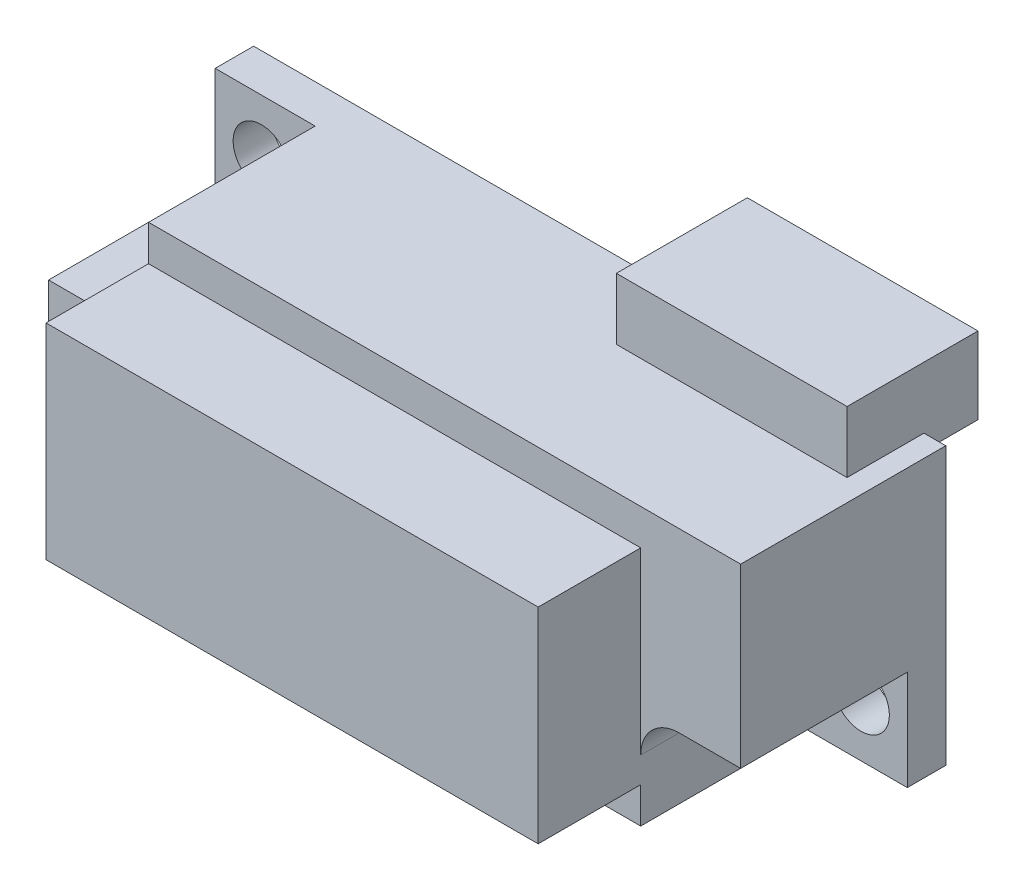
ISO-10303-21;
HEADER;
FILE_DESCRIPTION(('STEP AP214'),'2;1');
FILE_NAME('part.step','',(''),(''),'','','');
FILE_SCHEMA(('AUTOMOTIVE_DESIGN { 1 0 10303 214 1 1 1 1 }'));
ENDSEC;
DATA;
#1=APPLICATION_CONTEXT('core data for automotive mechanical design processes');
#2=APPLICATION_PROTOCOL_DEFINITION('international standard','automotive_design',2000,#1);
#3=PRODUCT_CONTEXT('',#1,'mechanical');
#4=PRODUCT('Part','Part','',(#3));
#5=PRODUCT_RELATED_PRODUCT_CATEGORY('part','',(#4));
#6=PRODUCT_DEFINITION_FORMATION('','',#4);
#7=PRODUCT_DEFINITION_CONTEXT('part definition',#1,'design');
#8=PRODUCT_DEFINITION('design','',#6,#7);
#9=PRODUCT_DEFINITION_SHAPE('','',#8);
#10=(LENGTH_UNIT() NAMED_UNIT(*) SI_UNIT(.MILLI.,.METRE.));
#11=(NAMED_UNIT(*) PLANE_ANGLE_UNIT() SI_UNIT($,.RADIAN.));
#12=(NAMED_UNIT(*) SI_UNIT($,.STERADIAN.) SOLID_ANGLE_UNIT());
#13=UNCERTAINTY_MEASURE_WITH_UNIT(LENGTH_MEASURE(1.E-05),#10,'distance_accuracy_value','');
#14=(GEOMETRIC_REPRESENTATION_CONTEXT(3) GLOBAL_UNCERTAINTY_ASSIGNED_CONTEXT((#13)) GLOBAL_UNIT_ASSIGNED_CONTEXT((#10,
#11,#12)) REPRESENTATION_CONTEXT('',''));
#15=CARTESIAN_POINT('',(0.,0.,0.));
#16=DIRECTION('',(0.,0.,1.));
#17=DIRECTION('',(1.,0.,0.));
#18=AXIS2_PLACEMENT_3D('',#15,#16,#17);
#19=CARTESIAN_POINT('',(-26.1452834227024,14.8512324203786,12.));
#20=DIRECTION('',(1.,0.,0.));
#21=DIRECTION('',(0.,1.,0.));
#22=AXIS2_PLACEMENT_3D('',#19,#20,#21);
#23=PLANE('',#22);
#24=DIRECTION('',(0.,-1.,0.));
#25=VECTOR('',#24,1.);
#26=CARTESIAN_POINT('',(-26.1452834227024,14.8512324203786,8.));
#27=LINE('',#26,#25);
#28=CARTESIAN_POINT('',(-26.1452834227024,10.9512324203803,8.));
#29=VERTEX_POINT('',#28);
#30=CARTESIAN_POINT('',(-26.1452834227024,4.05123242037859,8.));
#31=VERTEX_POINT('',#30);
#32=EDGE_CURVE('E245',#29,#31,#27,.T.);
#33=ORIENTED_EDGE('',*,*,#32,.F.);
#34=DIRECTION('',(0.,0.,1.));
#35=VECTOR('',#34,1.);
#36=CARTESIAN_POINT('',(-26.1452834227024,10.9512324203803,1.5));
#37=LINE('',#36,#35);
#38=CARTESIAN_POINT('',(-26.1452834227024,10.9512324203803,1.5));
#39=VERTEX_POINT('',#38);
#40=EDGE_CURVE('E310',#39,#29,#37,.T.);
#41=ORIENTED_EDGE('',*,*,#40,.F.);
#42=DIRECTION('',(0.,-1.,0.));
#43=VECTOR('',#42,1.);
#44=CARTESIAN_POINT('',(-26.1452834227024,14.8512324203786,1.5));
#45=LINE('',#44,#43);
#46=CARTESIAN_POINT('',(-26.1452834227024,14.8512324203786,1.5));
#47=VERTEX_POINT('',#46);
#48=EDGE_CURVE('E300',#47,#39,#45,.T.);
#49=ORIENTED_EDGE('',*,*,#48,.F.);
#50=DIRECTION('',(0.,0.,-1.));
#51=VECTOR('',#50,1.);
#52=CARTESIAN_POINT('',(-26.1452834227024,14.8512324203786,12.));
#53=LINE('',#52,#51);
#54=CARTESIAN_POINT('',(-26.1452834227024,14.8512324203786,0.));
#55=VERTEX_POINT('',#54);
#56=EDGE_CURVE('E331',#47,#55,#53,.T.);
#57=ORIENTED_EDGE('',*,*,#56,.T.);
#58=DIRECTION('',(0.,-1.,0.));
#59=VECTOR('',#58,1.);
#60=CARTESIAN_POINT('',(-26.1452834227024,14.8512324203786,0.));
#61=LINE('',#60,#59);
#62=CARTESIAN_POINT('',(-26.1452834227025,4.05123242037859,0.));
#63=VERTEX_POINT('',#62);
#64=EDGE_CURVE('E316',#55,#63,#61,.T.);
#65=ORIENTED_EDGE('',*,*,#64,.T.);
#66=DIRECTION('',(0.,0.,-1.));
#67=VECTOR('',#66,1.);
#68=CARTESIAN_POINT('',(-26.1452834227025,4.05123242037859,12.));
#69=LINE('',#68,#67);
#70=EDGE_CURVE('E338',#31,#63,#69,.T.);
#71=ORIENTED_EDGE('',*,*,#70,.F.);
#72=EDGE_LOOP('',(#33,#41,#49,#57,#65,#71));
#73=FACE_BOUND('',#72,.T.);
#74=ADVANCED_FACE('F34',(#73),#23,.F.);
#75=CARTESIAN_POINT('',(-26.1452834227025,4.05123242037859,12.));
#76=DIRECTION('',(0.,1.,0.));
#77=DIRECTION('',(0.,0.,1.));
#78=AXIS2_PLACEMENT_3D('',#75,#76,#77);
#79=PLANE('',#78);
#80=DIRECTION('',(1.,0.,0.));
#81=VECTOR('',#80,1.);
#82=CARTESIAN_POINT('',(-26.1452834227024,4.05123242037859,8.));
#83=LINE('',#82,#81);
#84=CARTESIAN_POINT('',(-3.04528342269798,4.05123242037859,8.));
#85=VERTEX_POINT('',#84);
#86=EDGE_CURVE('E254',#31,#85,#83,.T.);
#87=ORIENTED_EDGE('',*,*,#86,.F.);
#88=ORIENTED_EDGE('',*,*,#70,.T.);
#89=DIRECTION('',(1.,0.,0.));
#90=VECTOR('',#89,1.);
#91=CARTESIAN_POINT('',(-26.1452834227025,4.05123242037859,0.));
#92=LINE('',#91,#90);
#93=CARTESIAN_POINT('',(0.85471657729755,4.05123242037859,0.));
#94=VERTEX_POINT('',#93);
#95=EDGE_CURVE('E321',#63,#94,#92,.T.);
#96=ORIENTED_EDGE('',*,*,#95,.T.);
#97=DIRECTION('',(0.,0.,-1.));
#98=VECTOR('',#97,1.);
#99=CARTESIAN_POINT('',(0.85471657729755,4.05123242037859,12.));
#100=LINE('',#99,#98);
#101=CARTESIAN_POINT('',(0.85471657729755,4.05123242037859,1.5));
#102=VERTEX_POINT('',#101);
#103=EDGE_CURVE('E336',#102,#94,#100,.T.);
#104=ORIENTED_EDGE('',*,*,#103,.F.);
#105=DIRECTION('',(1.,0.,0.));
#106=VECTOR('',#105,1.);
#107=CARTESIAN_POINT('',(-3.04528342269798,4.05123242037859,1.5));
#108=LINE('',#107,#106);
#109=CARTESIAN_POINT('',(-3.04528342269798,4.05123242037859,1.5));
#110=VERTEX_POINT('',#109);
#111=EDGE_CURVE('E285',#110,#102,#108,.T.);
#112=ORIENTED_EDGE('',*,*,#111,.F.);
#113=DIRECTION('',(0.,0.,1.));
#114=VECTOR('',#113,1.);
#115=CARTESIAN_POINT('',(-3.04528342269798,4.05123242037859,1.5));
#116=LINE('',#115,#114);
#117=EDGE_CURVE('E291',#110,#85,#116,.T.);
#118=ORIENTED_EDGE('',*,*,#117,.T.);
#119=EDGE_LOOP('',(#87,#88,#96,#104,#112,#118));
#120=FACE_BOUND('',#119,.T.);
#121=ADVANCED_FACE('F408',(#120),#79,.F.);
#122=CARTESIAN_POINT('',(0.854716577297548,14.8512324203786,12.));
#123=DIRECTION('',(-1.,0.,0.));
#124=DIRECTION('',(0.,-1.,0.));
#125=AXIS2_PLACEMENT_3D('',#122,#123,#124);
#126=PLANE('',#125);
#127=DIRECTION('',(0.,1.,0.));
#128=VECTOR('',#127,1.);
#129=CARTESIAN_POINT('',(0.85471657729755,14.8512324203786,8.));
#130=LINE('',#129,#128);
#131=CARTESIAN_POINT('',(0.85471657729755,7.95123242037313,8.));
#132=VERTEX_POINT('',#131);
#133=CARTESIAN_POINT('',(0.85471657729755,14.8512324203786,8.));
#134=VERTEX_POINT('',#133);
#135=EDGE_CURVE('E256',#132,#134,#130,.T.);
#136=ORIENTED_EDGE('',*,*,#135,.F.);
#137=DIRECTION('',(0.,0.,1.));
#138=VECTOR('',#137,1.);
#139=CARTESIAN_POINT('',(0.85471657729755,7.95123242037313,1.5));
#140=LINE('',#139,#138);
#141=CARTESIAN_POINT('',(0.85471657729755,7.95123242037313,1.5));
#142=VERTEX_POINT('',#141);
#143=EDGE_CURVE('E294',#142,#132,#140,.T.);
#144=ORIENTED_EDGE('',*,*,#143,.F.);
#145=DIRECTION('',(0.,1.,0.));
#146=VECTOR('',#145,1.);
#147=CARTESIAN_POINT('',(0.85471657729755,7.95123242037313,1.5));
#148=LINE('',#147,#146);
#149=EDGE_CURVE('E287',#102,#142,#148,.T.);
#150=ORIENTED_EDGE('',*,*,#149,.F.);
#151=ORIENTED_EDGE('',*,*,#103,.T.);
#152=DIRECTION('',(0.,1.,0.));
#153=VECTOR('',#152,1.);
#154=CARTESIAN_POINT('',(0.854716577297548,14.8512324203786,0.));
#155=LINE('',#154,#153);
#156=CARTESIAN_POINT('',(0.854716577297548,14.8512324203786,0.));
#157=VERTEX_POINT('',#156);
#158=EDGE_CURVE('E324',#94,#157,#155,.T.);
#159=ORIENTED_EDGE('',*,*,#158,.T.);
#160=DIRECTION('',(0.,0.,-1.));
#161=VECTOR('',#160,1.);
#162=CARTESIAN_POINT('',(0.854716577297548,14.8512324203786,12.));
#163=LINE('',#162,#161);
#164=EDGE_CURVE('E334',#134,#157,#163,.T.);
#165=ORIENTED_EDGE('',*,*,#164,.F.);
#166=EDGE_LOOP('',(#136,#144,#150,#151,#159,#165));
#167=FACE_BOUND('',#166,.T.);
#168=ADVANCED_FACE('F370',(#167),#126,.F.);
#169=CARTESIAN_POINT('',(-26.1452834227024,14.8512324203786,12.));
#170=DIRECTION('',(0.,-1.,0.));
#171=DIRECTION('',(0.,0.,-1.));
#172=AXIS2_PLACEMENT_3D('',#169,#170,#171);
#173=PLANE('',#172);
#174=DIRECTION('',(-1.,0.,0.));
#175=VECTOR('',#174,1.);
#176=CARTESIAN_POINT('',(-26.1452834227024,14.8512324203786,0.));
#177=LINE('',#176,#175);
#178=CARTESIAN_POINT('',(0.00471657729754944,14.8512324203786,0.));
#179=VERTEX_POINT('',#178);
#180=EDGE_CURVE('E328',#157,#179,#177,.T.);
#181=ORIENTED_EDGE('',*,*,#180,.T.);
#182=DIRECTION('',(0.,0.,1.));
#183=VECTOR('',#182,1.);
#184=CARTESIAN_POINT('',(0.00471657729755187,14.8512324203786,12.));
#185=LINE('',#184,#183);
#186=CARTESIAN_POINT('',(0.00471657729754944,14.8512324203786,3.));
#187=VERTEX_POINT('',#186);
#188=EDGE_CURVE('E223',#179,#187,#185,.T.);
#189=ORIENTED_EDGE('',*,*,#188,.T.);
#190=DIRECTION('',(1.,0.,0.));
#191=VECTOR('',#190,1.);
#192=CARTESIAN_POINT('',(-26.1452834227024,14.8512324203786,3.));
#193=LINE('',#192,#191);
#194=CARTESIAN_POINT('',(-8.99528342270245,14.8512324203786,3.));
#195=VERTEX_POINT('',#194);
#196=EDGE_CURVE('E11',#195,#187,#193,.T.);
#197=ORIENTED_EDGE('',*,*,#196,.F.);
#198=DIRECTION('',(0.,0.,-1.));
#199=VECTOR('',#198,1.);
#200=CARTESIAN_POINT('',(-8.99528342270245,14.8512324203786,12.));
#201=LINE('',#200,#199);
#202=CARTESIAN_POINT('',(-8.99528342270245,14.8512324203786,0.));
#203=VERTEX_POINT('',#202);
#204=EDGE_CURVE('E217',#195,#203,#201,.T.);
#205=ORIENTED_EDGE('',*,*,#204,.T.);
#206=EDGE_CURVE('E327',#203,#55,#177,.T.);
#207=ORIENTED_EDGE('',*,*,#206,.T.);
#208=ORIENTED_EDGE('',*,*,#56,.F.);
#209=DIRECTION('',(-1.,0.,0.));
#210=VECTOR('',#209,1.);
#211=CARTESIAN_POINT('',(-26.1452834227024,14.8512324203786,1.5));
#212=LINE('',#211,#210);
#213=CARTESIAN_POINT('',(-22.245283422704,14.8512324203786,1.5));
#214=VERTEX_POINT('',#213);
#215=EDGE_CURVE('E308',#214,#47,#212,.T.);
#216=ORIENTED_EDGE('',*,*,#215,.F.);
#217=DIRECTION('',(0.,0.,1.));
#218=VECTOR('',#217,1.);
#219=CARTESIAN_POINT('',(-22.245283422704,14.8512324203786,1.5));
#220=LINE('',#219,#218);
#221=CARTESIAN_POINT('',(-22.245283422704,14.8512324203786,8.));
#222=VERTEX_POINT('',#221);
#223=EDGE_CURVE('E313',#214,#222,#220,.T.);
#224=ORIENTED_EDGE('',*,*,#223,.T.);
#225=DIRECTION('',(-1.,0.,0.));
#226=VECTOR('',#225,1.);
#227=CARTESIAN_POINT('',(-26.1452834227024,14.8512324203786,8.));
#228=LINE('',#227,#226);
#229=EDGE_CURVE('E258',#134,#222,#228,.T.);
#230=ORIENTED_EDGE('',*,*,#229,.F.);
#231=ORIENTED_EDGE('',*,*,#164,.T.);
#232=EDGE_LOOP('',(#181,#189,#197,#205,#207,#208,#216,#224,#230,#231));
#233=FACE_BOUND('',#232,.T.);
#234=ADVANCED_FACE('F364',(#233),#173,.F.);
#235=CARTESIAN_POINT('',(0.,0.,12.));
#236=DIRECTION('',(0.,0.,1.));
#237=DIRECTION('',(1.,0.,0.));
#238=AXIS2_PLACEMENT_3D('',#235,#236,#237);
#239=PLANE('',#238);
#240=DIRECTION('',(0.,-1.,0.));
#241=VECTOR('',#240,1.);
#242=CARTESIAN_POINT('',(-3.04528342269798,7.95123242037313,12.));
#243=LINE('',#242,#241);
#244=CARTESIAN_POINT('',(-3.04528342270245,13.4512324203786,12.));
#245=VERTEX_POINT('',#244);
#246=CARTESIAN_POINT('',(-3.04528342270245,5.4512324203786,12.));
#247=VERTEX_POINT('',#246);
#248=EDGE_CURVE('E282',#245,#247,#243,.T.);
#249=ORIENTED_EDGE('',*,*,#248,.F.);
#250=DIRECTION('',(-1.,0.,0.));
#251=VECTOR('',#250,1.);
#252=CARTESIAN_POINT('',(-22.2452834227024,13.4512324203786,12.));
#253=LINE('',#252,#251);
#254=CARTESIAN_POINT('',(-22.2452834227024,13.4512324203786,12.));
#255=VERTEX_POINT('',#254);
#256=EDGE_CURVE('E230',#245,#255,#253,.T.);
#257=ORIENTED_EDGE('',*,*,#256,.T.);
#258=DIRECTION('',(0.,1.,0.));
#259=VECTOR('',#258,1.);
#260=CARTESIAN_POINT('',(-22.245283422704,14.8512324203786,12.));
#261=LINE('',#260,#259);
#262=CARTESIAN_POINT('',(-22.2452834227024,5.4512324203786,12.));
#263=VERTEX_POINT('',#262);
#264=EDGE_CURVE('E297',#263,#255,#261,.T.);
#265=ORIENTED_EDGE('',*,*,#264,.F.);
#266=DIRECTION('',(1.,0.,0.));
#267=VECTOR('',#266,1.);
#268=CARTESIAN_POINT('',(-22.2452834227024,5.4512324203786,12.));
#269=LINE('',#268,#267);
#270=EDGE_CURVE('E226',#263,#247,#269,.T.);
#271=ORIENTED_EDGE('',*,*,#270,.T.);
#272=EDGE_LOOP('',(#249,#257,#265,#271));
#273=FACE_BOUND('',#272,.T.);
#274=ADVANCED_FACE('F454',(#273),#239,.T.);
#275=CARTESIAN_POINT('',(-26.1452834227024,10.9512324203803,1.5));
#276=DIRECTION('',(0.,-1.,0.));
#277=DIRECTION('',(0.,0.,-1.));
#278=AXIS2_PLACEMENT_3D('',#275,#276,#277);
#279=PLANE('',#278);
#280=DIRECTION('',(-1.,0.,0.));
#281=VECTOR('',#280,1.);
#282=CARTESIAN_POINT('',(-26.1452834227024,10.9512324203803,8.));
#283=LINE('',#282,#281);
#284=CARTESIAN_POINT('',(-23.745283422704,10.9512324203803,8.));
#285=VERTEX_POINT('',#284);
#286=EDGE_CURVE('E264',#285,#29,#283,.T.);
#287=ORIENTED_EDGE('',*,*,#286,.F.);
#288=DIRECTION('',(0.,0.,1.));
#289=VECTOR('',#288,1.);
#290=CARTESIAN_POINT('',(-23.745283422704,10.9512324203803,1.5));
#291=LINE('',#290,#289);
#292=CARTESIAN_POINT('',(-23.745283422704,10.9512324203803,1.5));
#293=VERTEX_POINT('',#292);
#294=EDGE_CURVE('E343',#285,#293,#291,.F.);
#295=ORIENTED_EDGE('',*,*,#294,.T.);
#296=DIRECTION('',(1.,0.,0.));
#297=VECTOR('',#296,1.);
#298=CARTESIAN_POINT('',(-26.1452834227024,10.9512324203803,1.5));
#299=LINE('',#298,#297);
#300=EDGE_CURVE('E303',#39,#293,#299,.T.);
#301=ORIENTED_EDGE('',*,*,#300,.F.);
#302=ORIENTED_EDGE('',*,*,#40,.T.);
#303=EDGE_LOOP('',(#287,#295,#301,#302));
#304=FACE_BOUND('',#303,.T.);
#305=ADVANCED_FACE('F424',(#304),#279,.F.);
#306=CARTESIAN_POINT('',(-3.04528342269798,7.95123242037313,1.5));
#307=DIRECTION('',(0.,1.,0.));
#308=DIRECTION('',(0.,0.,1.));
#309=AXIS2_PLACEMENT_3D('',#306,#307,#308);
#310=PLANE('',#309);
#311=DIRECTION('',(1.,0.,0.));
#312=VECTOR('',#311,1.);
#313=CARTESIAN_POINT('',(-3.04528342269798,7.95123242037313,8.));
#314=LINE('',#313,#312);
#315=CARTESIAN_POINT('',(-1.54528342269798,7.95123242037313,8.));
#316=VERTEX_POINT('',#315);
#317=EDGE_CURVE('E260',#316,#132,#314,.T.);
#318=ORIENTED_EDGE('',*,*,#317,.F.);
#319=DIRECTION('',(0.,0.,1.));
#320=VECTOR('',#319,1.);
#321=CARTESIAN_POINT('',(-1.54528342269798,7.95123242037313,1.5));
#322=LINE('',#321,#320);
#323=CARTESIAN_POINT('',(-1.54528342269798,7.95123242037313,1.5));
#324=VERTEX_POINT('',#323);
#325=EDGE_CURVE('E57',#316,#324,#322,.F.);
#326=ORIENTED_EDGE('',*,*,#325,.T.);
#327=DIRECTION('',(-1.,0.,0.));
#328=VECTOR('',#327,1.);
#329=CARTESIAN_POINT('',(-3.04528342269798,7.95123242037313,1.5));
#330=LINE('',#329,#328);
#331=EDGE_CURVE('E289',#142,#324,#330,.T.);
#332=ORIENTED_EDGE('',*,*,#331,.F.);
#333=ORIENTED_EDGE('',*,*,#143,.T.);
#334=EDGE_LOOP('',(#318,#326,#332,#333));
#335=FACE_BOUND('',#334,.T.);
#336=ADVANCED_FACE('F417',(#335),#310,.F.);
#337=CARTESIAN_POINT('',(-23.745283422704,12.4512324203803,1.5));
#338=DIRECTION('',(0.,0.,-1.));
#339=DIRECTION('',(-1.,0.,0.));
#340=AXIS2_PLACEMENT_3D('',#337,#338,#339);
#341=CYLINDRICAL_SURFACE('',#340,1.5);
#342=CARTESIAN_POINT('',(-23.745283422704,12.4512324203803,8.));
#343=DIRECTION('',(0.,0.,1.));
#344=DIRECTION('',(1.,0.,0.));
#345=AXIS2_PLACEMENT_3D('',#342,#343,#344);
#346=CIRCLE('',#345,1.5);
#347=CARTESIAN_POINT('',(-22.2452834227024,12.4512324203803,8.));
#348=VERTEX_POINT('',#347);
#349=EDGE_CURVE('E262',#348,#285,#346,.F.);
#350=ORIENTED_EDGE('',*,*,#349,.F.);
#351=DIRECTION('',(0.,0.,1.));
#352=VECTOR('',#351,1.);
#353=CARTESIAN_POINT('',(-22.245283422704,12.4512324203803,12.));
#354=LINE('',#353,#352);
#355=CARTESIAN_POINT('',(-22.245283422704,12.4512324203803,1.5));
#356=VERTEX_POINT('',#355);
#357=EDGE_CURVE('E340',#356,#348,#354,.T.);
#358=ORIENTED_EDGE('',*,*,#357,.F.);
#359=CARTESIAN_POINT('',(-23.745283422704,12.4512324203803,1.5));
#360=DIRECTION('',(0.,0.,1.));
#361=DIRECTION('',(1.,0.,0.));
#362=AXIS2_PLACEMENT_3D('',#359,#360,#361);
#363=CIRCLE('',#362,1.5);
#364=EDGE_CURVE('E345',#293,#356,#363,.T.);
#365=ORIENTED_EDGE('',*,*,#364,.F.);
#366=ORIENTED_EDGE('',*,*,#294,.F.);
#367=EDGE_LOOP('',(#350,#358,#365,#366));
#368=FACE_BOUND('',#367,.T.);
#369=ADVANCED_FACE('F415',(#368),#341,.F.);
#370=CARTESIAN_POINT('',(-1.54528342269798,6.45123242037313,1.5));
#371=DIRECTION('',(0.,0.,-1.));
#372=DIRECTION('',(-1.,0.,0.));
#373=AXIS2_PLACEMENT_3D('',#370,#371,#372);
#374=CYLINDRICAL_SURFACE('',#373,1.5);
#375=CARTESIAN_POINT('',(-1.54528342269798,6.45123242037313,8.));
#376=DIRECTION('',(0.,0.,1.));
#377=DIRECTION('',(1.,0.,0.));
#378=AXIS2_PLACEMENT_3D('',#375,#376,#377);
#379=CIRCLE('',#378,1.5);
#380=CARTESIAN_POINT('',(-3.04528342270245,6.45123242037313,8.));
#381=VERTEX_POINT('',#380);
#382=EDGE_CURVE('E353',#381,#316,#379,.F.);
#383=ORIENTED_EDGE('',*,*,#382,.F.);
#384=DIRECTION('',(0.,0.,1.));
#385=VECTOR('',#384,1.);
#386=CARTESIAN_POINT('',(-3.04528342269798,6.45123242037313,12.));
#387=LINE('',#386,#385);
#388=CARTESIAN_POINT('',(-3.04528342269798,6.45123242037313,1.5));
#389=VERTEX_POINT('',#388);
#390=EDGE_CURVE('E347',#389,#381,#387,.T.);
#391=ORIENTED_EDGE('',*,*,#390,.F.);
#392=CARTESIAN_POINT('',(-1.54528342269798,6.45123242037313,1.5));
#393=DIRECTION('',(0.,0.,1.));
#394=DIRECTION('',(1.,0.,0.));
#395=AXIS2_PLACEMENT_3D('',#392,#393,#394);
#396=CIRCLE('',#395,1.5);
#397=EDGE_CURVE('E351',#324,#389,#396,.T.);
#398=ORIENTED_EDGE('',*,*,#397,.F.);
#399=ORIENTED_EDGE('',*,*,#325,.F.);
#400=EDGE_LOOP('',(#383,#391,#398,#399));
#401=FACE_BOUND('',#400,.T.);
#402=ADVANCED_FACE('F36',(#401),#374,.F.);
#403=CARTESIAN_POINT('',(0.,0.,0.));
#404=DIRECTION('',(0.,0.,1.));
#405=DIRECTION('',(1.,0.,0.));
#406=AXIS2_PLACEMENT_3D('',#403,#404,#405);
#407=PLANE('',#406);
#408=CARTESIAN_POINT('',(-0.94528342270245,6.1512324203786,0.));
#409=DIRECTION('',(0.,0.,1.));
#410=DIRECTION('',(1.,0.,0.));
#411=AXIS2_PLACEMENT_3D('',#408,#409,#410);
#412=CIRCLE('',#411,1.1);
#413=CARTESIAN_POINT('',(0.15471657729755,6.1512324203786,0.));
#414=VERTEX_POINT('',#413);
#415=EDGE_CURVE('E273',#414,#414,#412,.T.);
#416=ORIENTED_EDGE('',*,*,#415,.T.);
#417=EDGE_LOOP('',(#416));
#418=FACE_BOUND('',#417,.T.);
#419=CARTESIAN_POINT('',(-24.3452834227024,12.7512324203786,0.));
#420=DIRECTION('',(0.,0.,1.));
#421=DIRECTION('',(1.,0.,0.));
#422=AXIS2_PLACEMENT_3D('',#419,#420,#421);
#423=CIRCLE('',#422,1.1);
#424=CARTESIAN_POINT('',(-23.2452834227024,12.7512324203786,0.));
#425=VERTEX_POINT('',#424);
#426=EDGE_CURVE('E279',#425,#425,#423,.T.);
#427=ORIENTED_EDGE('',*,*,#426,.T.);
#428=EDGE_LOOP('',(#427));
#429=FACE_BOUND('',#428,.T.);
#430=DIRECTION('',(1.,0.,0.));
#431=VECTOR('',#430,1.);
#432=CARTESIAN_POINT('',(0.,14.2512324203786,0.));
#433=LINE('',#432,#431);
#434=CARTESIAN_POINT('',(-8.99528342270245,14.2512324203786,0.));
#435=VERTEX_POINT('',#434);
#436=CARTESIAN_POINT('',(0.00471657729754927,14.2512324203786,0.));
#437=VERTEX_POINT('',#436);
#438=EDGE_CURVE('E355',#435,#437,#433,.T.);
#439=ORIENTED_EDGE('',*,*,#438,.T.);
#440=DIRECTION('',(0.,1.,0.));
#441=VECTOR('',#440,1.);
#442=CARTESIAN_POINT('',(0.00471657729754515,0.,0.));
#443=LINE('',#442,#441);
#444=EDGE_CURVE('E42',#437,#179,#443,.T.);
#445=ORIENTED_EDGE('',*,*,#444,.T.);
#446=ORIENTED_EDGE('',*,*,#180,.F.);
#447=ORIENTED_EDGE('',*,*,#158,.F.);
#448=ORIENTED_EDGE('',*,*,#95,.F.);
#449=ORIENTED_EDGE('',*,*,#64,.F.);
#450=ORIENTED_EDGE('',*,*,#206,.F.);
#451=DIRECTION('',(0.,-1.,0.));
#452=VECTOR('',#451,1.);
#453=CARTESIAN_POINT('',(-8.99528342270244,0.,0.));
#454=LINE('',#453,#452);
#455=EDGE_CURVE('E357',#203,#435,#454,.T.);
#456=ORIENTED_EDGE('',*,*,#455,.T.);
#457=EDGE_LOOP('',(#439,#445,#446,#447,#448,#449,#450,#456));
#458=FACE_BOUND('',#457,.T.);
#459=ADVANCED_FACE('F361',(#418,#429,#458),#407,.F.);
#460=CARTESIAN_POINT('',(-22.245283422704,14.8512324203786,1.5));
#461=DIRECTION('',(1.,0.,0.));
#462=DIRECTION('',(0.,0.,-1.));
#463=AXIS2_PLACEMENT_3D('',#460,#461,#462);
#464=PLANE('',#463);
#465=DIRECTION('',(0.,0.,1.));
#466=VECTOR('',#465,1.);
#467=CARTESIAN_POINT('',(-22.2452834227024,13.4512324203786,8.));
#468=LINE('',#467,#466);
#469=CARTESIAN_POINT('',(-22.2452834227024,13.4512324203786,8.));
#470=VERTEX_POINT('',#469);
#471=EDGE_CURVE('E243',#470,#255,#468,.T.);
#472=ORIENTED_EDGE('',*,*,#471,.F.);
#473=DIRECTION('',(0.,-1.,0.));
#474=VECTOR('',#473,1.);
#475=CARTESIAN_POINT('',(-22.245283422704,14.8512324203786,8.));
#476=LINE('',#475,#474);
#477=EDGE_CURVE('E268',#222,#470,#476,.T.);
#478=ORIENTED_EDGE('',*,*,#477,.F.);
#479=ORIENTED_EDGE('',*,*,#223,.F.);
#480=DIRECTION('',(0.,1.,0.));
#481=VECTOR('',#480,1.);
#482=CARTESIAN_POINT('',(-22.245283422704,14.8512324203786,1.5));
#483=LINE('',#482,#481);
#484=EDGE_CURVE('E306',#356,#214,#483,.T.);
#485=ORIENTED_EDGE('',*,*,#484,.F.);
#486=ORIENTED_EDGE('',*,*,#357,.T.);
#487=DIRECTION('',(0.,-1.,0.));
#488=VECTOR('',#487,1.);
#489=CARTESIAN_POINT('',(-22.2452834227024,13.4512324203786,8.));
#490=LINE('',#489,#488);
#491=CARTESIAN_POINT('',(-22.2452834227024,5.4512324203786,8.));
#492=VERTEX_POINT('',#491);
#493=EDGE_CURVE('E227',#348,#492,#490,.T.);
#494=ORIENTED_EDGE('',*,*,#493,.T.);
#495=DIRECTION('',(0.,0.,1.));
#496=VECTOR('',#495,1.);
#497=CARTESIAN_POINT('',(-22.2452834227024,5.4512324203786,8.));
#498=LINE('',#497,#496);
#499=EDGE_CURVE('E238',#492,#263,#498,.T.);
#500=ORIENTED_EDGE('',*,*,#499,.T.);
#501=ORIENTED_EDGE('',*,*,#264,.T.);
#502=EDGE_LOOP('',(#472,#478,#479,#485,#486,#494,#500,#501));
#503=FACE_BOUND('',#502,.T.);
#504=ADVANCED_FACE('F435',(#503),#464,.F.);
#505=CARTESIAN_POINT('',(0.,0.,1.5));
#506=DIRECTION('',(0.,0.,1.));
#507=DIRECTION('',(1.,0.,0.));
#508=AXIS2_PLACEMENT_3D('',#505,#506,#507);
#509=PLANE('',#508);
#510=CARTESIAN_POINT('',(-24.3452834227024,12.7512324203786,1.5));
#511=DIRECTION('',(0.,0.,1.));
#512=DIRECTION('',(1.,0.,0.));
#513=AXIS2_PLACEMENT_3D('',#510,#511,#512);
#514=CIRCLE('',#513,1.1);
#515=CARTESIAN_POINT('',(-23.2452834227024,12.7512324203786,1.5));
#516=VERTEX_POINT('',#515);
#517=EDGE_CURVE('E276',#516,#516,#514,.T.);
#518=ORIENTED_EDGE('',*,*,#517,.F.);
#519=EDGE_LOOP('',(#518));
#520=FACE_BOUND('',#519,.T.);
#521=ORIENTED_EDGE('',*,*,#300,.T.);
#522=ORIENTED_EDGE('',*,*,#364,.T.);
#523=ORIENTED_EDGE('',*,*,#484,.T.);
#524=ORIENTED_EDGE('',*,*,#215,.T.);
#525=ORIENTED_EDGE('',*,*,#48,.T.);
#526=EDGE_LOOP('',(#521,#522,#523,#524,#525));
#527=FACE_BOUND('',#526,.T.);
#528=ADVANCED_FACE('F440',(#520,#527),#509,.T.);
#529=CARTESIAN_POINT('',(-3.04528342269798,7.95123242037313,1.5));
#530=DIRECTION('',(-1.,0.,0.));
#531=DIRECTION('',(0.,0.,1.));
#532=AXIS2_PLACEMENT_3D('',#529,#530,#531);
#533=PLANE('',#532);
#534=DIRECTION('',(0.,0.,1.));
#535=VECTOR('',#534,1.);
#536=CARTESIAN_POINT('',(-3.04528342270245,5.4512324203786,8.));
#537=LINE('',#536,#535);
#538=CARTESIAN_POINT('',(-3.04528342270245,5.4512324203786,8.));
#539=VERTEX_POINT('',#538);
#540=EDGE_CURVE('E249',#539,#247,#537,.T.);
#541=ORIENTED_EDGE('',*,*,#540,.F.);
#542=DIRECTION('',(0.,1.,0.));
#543=VECTOR('',#542,1.);
#544=CARTESIAN_POINT('',(-3.04528342269798,7.95123242037313,8.));
#545=LINE('',#544,#543);
#546=EDGE_CURVE('E266',#85,#539,#545,.T.);
#547=ORIENTED_EDGE('',*,*,#546,.F.);
#548=ORIENTED_EDGE('',*,*,#117,.F.);
#549=DIRECTION('',(0.,-1.,0.));
#550=VECTOR('',#549,1.);
#551=CARTESIAN_POINT('',(-3.04528342269798,7.95123242037313,1.5));
#552=LINE('',#551,#550);
#553=EDGE_CURVE('E283',#389,#110,#552,.T.);
#554=ORIENTED_EDGE('',*,*,#553,.F.);
#555=ORIENTED_EDGE('',*,*,#390,.T.);
#556=DIRECTION('',(0.,1.,0.));
#557=VECTOR('',#556,1.);
#558=CARTESIAN_POINT('',(-3.04528342270245,13.4512324203786,8.));
#559=LINE('',#558,#557);
#560=CARTESIAN_POINT('',(-3.04528342270245,13.4512324203786,8.));
#561=VERTEX_POINT('',#560);
#562=EDGE_CURVE('E233',#381,#561,#559,.T.);
#563=ORIENTED_EDGE('',*,*,#562,.T.);
#564=DIRECTION('',(0.,0.,1.));
#565=VECTOR('',#564,1.);
#566=CARTESIAN_POINT('',(-3.04528342270245,13.4512324203786,8.));
#567=LINE('',#566,#565);
#568=EDGE_CURVE('E246',#561,#245,#567,.T.);
#569=ORIENTED_EDGE('',*,*,#568,.T.);
#570=ORIENTED_EDGE('',*,*,#248,.T.);
#571=EDGE_LOOP('',(#541,#547,#548,#554,#555,#563,#569,#570));
#572=FACE_BOUND('',#571,.T.);
#573=ADVANCED_FACE('F449',(#572),#533,.F.);
#574=CARTESIAN_POINT('',(0.,0.,1.5));
#575=DIRECTION('',(0.,0.,1.));
#576=DIRECTION('',(1.,0.,0.));
#577=AXIS2_PLACEMENT_3D('',#574,#575,#576);
#578=PLANE('',#577);
#579=CARTESIAN_POINT('',(-0.94528342270245,6.1512324203786,1.5));
#580=DIRECTION('',(0.,0.,1.));
#581=DIRECTION('',(1.,0.,0.));
#582=AXIS2_PLACEMENT_3D('',#579,#580,#581);
#583=CIRCLE('',#582,1.1);
#584=CARTESIAN_POINT('',(0.15471657729755,6.1512324203786,1.5));
#585=VERTEX_POINT('',#584);
#586=EDGE_CURVE('E270',#585,#585,#583,.T.);
#587=ORIENTED_EDGE('',*,*,#586,.F.);
#588=EDGE_LOOP('',(#587));
#589=FACE_BOUND('',#588,.T.);
#590=ORIENTED_EDGE('',*,*,#331,.T.);
#591=ORIENTED_EDGE('',*,*,#397,.T.);
#592=ORIENTED_EDGE('',*,*,#553,.T.);
#593=ORIENTED_EDGE('',*,*,#111,.T.);
#594=ORIENTED_EDGE('',*,*,#149,.T.);
#595=EDGE_LOOP('',(#590,#591,#592,#593,#594));
#596=FACE_BOUND('',#595,.T.);
#597=ADVANCED_FACE('F466',(#589,#596),#578,.T.);
#598=CARTESIAN_POINT('',(-24.3452834227024,12.7512324203786,-0.600000000000001));
#599=DIRECTION('',(0.,0.,1.));
#600=DIRECTION('',(1.,0.,0.));
#601=AXIS2_PLACEMENT_3D('',#598,#599,#600);
#602=CYLINDRICAL_SURFACE('',#601,1.1);
#603=ORIENTED_EDGE('',*,*,#517,.T.);
#604=EDGE_LOOP('',(#603));
#605=FACE_BOUND('',#604,.T.);
#606=ORIENTED_EDGE('',*,*,#426,.F.);
#607=EDGE_LOOP('',(#606));
#608=FACE_BOUND('',#607,.T.);
#609=ADVANCED_FACE('F468',(#605,#608),#602,.F.);
#610=CARTESIAN_POINT('',(-0.94528342270245,6.1512324203786,-0.600000000000001));
#611=DIRECTION('',(0.,0.,1.));
#612=DIRECTION('',(1.,0.,0.));
#613=AXIS2_PLACEMENT_3D('',#610,#611,#612);
#614=CYLINDRICAL_SURFACE('',#613,1.1);
#615=ORIENTED_EDGE('',*,*,#586,.T.);
#616=EDGE_LOOP('',(#615));
#617=FACE_BOUND('',#616,.T.);
#618=ORIENTED_EDGE('',*,*,#415,.F.);
#619=EDGE_LOOP('',(#618));
#620=FACE_BOUND('',#619,.T.);
#621=ADVANCED_FACE('F475',(#617,#620),#614,.F.);
#622=CARTESIAN_POINT('',(0.,0.,8.));
#623=DIRECTION('',(0.,0.,1.));
#624=DIRECTION('',(1.,0.,0.));
#625=AXIS2_PLACEMENT_3D('',#622,#623,#624);
#626=PLANE('',#625);
#627=ORIENTED_EDGE('',*,*,#477,.T.);
#628=DIRECTION('',(-1.,0.,0.));
#629=VECTOR('',#628,1.);
#630=CARTESIAN_POINT('',(-22.2452834227024,13.4512324203786,8.));
#631=LINE('',#630,#629);
#632=EDGE_CURVE('E235',#561,#470,#631,.T.);
#633=ORIENTED_EDGE('',*,*,#632,.F.);
#634=ORIENTED_EDGE('',*,*,#562,.F.);
#635=ORIENTED_EDGE('',*,*,#382,.T.);
#636=ORIENTED_EDGE('',*,*,#317,.T.);
#637=ORIENTED_EDGE('',*,*,#135,.T.);
#638=ORIENTED_EDGE('',*,*,#229,.T.);
#639=EDGE_LOOP('',(#627,#633,#634,#635,#636,#637,#638));
#640=FACE_BOUND('',#639,.T.);
#641=ADVANCED_FACE('F461',(#640),#626,.T.);
#642=CARTESIAN_POINT('',(-22.2452834227024,13.4512324203786,8.));
#643=DIRECTION('',(0.,1.,0.));
#644=DIRECTION('',(0.,0.,1.));
#645=AXIS2_PLACEMENT_3D('',#642,#643,#644);
#646=PLANE('',#645);
#647=ORIENTED_EDGE('',*,*,#256,.F.);
#648=ORIENTED_EDGE('',*,*,#568,.F.);
#649=ORIENTED_EDGE('',*,*,#632,.T.);
#650=ORIENTED_EDGE('',*,*,#471,.T.);
#651=EDGE_LOOP('',(#647,#648,#649,#650));
#652=FACE_BOUND('',#651,.T.);
#653=ADVANCED_FACE('F458',(#652),#646,.T.);
#654=ORIENTED_EDGE('',*,*,#546,.T.);
#655=DIRECTION('',(1.,0.,0.));
#656=VECTOR('',#655,1.);
#657=CARTESIAN_POINT('',(-22.2452834227024,5.4512324203786,8.));
#658=LINE('',#657,#656);
#659=EDGE_CURVE('E229',#492,#539,#658,.T.);
#660=ORIENTED_EDGE('',*,*,#659,.F.);
#661=ORIENTED_EDGE('',*,*,#493,.F.);
#662=ORIENTED_EDGE('',*,*,#349,.T.);
#663=ORIENTED_EDGE('',*,*,#286,.T.);
#664=ORIENTED_EDGE('',*,*,#32,.T.);
#665=ORIENTED_EDGE('',*,*,#86,.T.);
#666=EDGE_LOOP('',(#654,#660,#661,#662,#663,#664,#665));
#667=FACE_BOUND('',#666,.T.);
#668=ADVANCED_FACE('F402',(#667),#626,.T.);
#669=CARTESIAN_POINT('',(-22.2452834227024,5.4512324203786,8.));
#670=DIRECTION('',(0.,-1.,0.));
#671=DIRECTION('',(0.,0.,-1.));
#672=AXIS2_PLACEMENT_3D('',#669,#670,#671);
#673=PLANE('',#672);
#674=ORIENTED_EDGE('',*,*,#270,.F.);
#675=ORIENTED_EDGE('',*,*,#499,.F.);
#676=ORIENTED_EDGE('',*,*,#659,.T.);
#677=ORIENTED_EDGE('',*,*,#540,.T.);
#678=EDGE_LOOP('',(#674,#675,#676,#677));
#679=FACE_BOUND('',#678,.T.);
#680=ADVANCED_FACE('F395',(#679),#673,.T.);
#681=CARTESIAN_POINT('',(0.,0.,3.));
#682=DIRECTION('',(0.,0.,-1.));
#683=DIRECTION('',(-1.,0.,0.));
#684=AXIS2_PLACEMENT_3D('',#681,#682,#683);
#685=PLANE('',#684);
#686=DIRECTION('',(0.,1.,0.));
#687=VECTOR('',#686,1.);
#688=CARTESIAN_POINT('',(-8.99528342270245,17.2512324203786,3.));
#689=LINE('',#688,#687);
#690=CARTESIAN_POINT('',(-8.99528342270245,17.2512324203786,3.));
#691=VERTEX_POINT('',#690);
#692=EDGE_CURVE('E211',#195,#691,#689,.T.);
#693=ORIENTED_EDGE('',*,*,#692,.F.);
#694=ORIENTED_EDGE('',*,*,#196,.T.);
#695=DIRECTION('',(0.,-1.,0.));
#696=VECTOR('',#695,1.);
#697=CARTESIAN_POINT('',(0.00471657729755014,17.2512324203786,3.));
#698=LINE('',#697,#696);
#699=CARTESIAN_POINT('',(0.00471657729755014,17.2512324203786,3.));
#700=VERTEX_POINT('',#699);
#701=EDGE_CURVE('E208',#700,#187,#698,.T.);
#702=ORIENTED_EDGE('',*,*,#701,.F.);
#703=DIRECTION('',(1.,0.,0.));
#704=VECTOR('',#703,1.);
#705=CARTESIAN_POINT('',(0.00471657729755014,17.2512324203786,3.));
#706=LINE('',#705,#704);
#707=EDGE_CURVE('E189',#691,#700,#706,.T.);
#708=ORIENTED_EDGE('',*,*,#707,.F.);
#709=EDGE_LOOP('',(#693,#694,#702,#708));
#710=FACE_BOUND('',#709,.T.);
#711=ADVANCED_FACE('F393',(#710),#685,.F.);
#712=CARTESIAN_POINT('',(0.00471657729755014,17.2512324203786,3.));
#713=DIRECTION('',(1.,0.,0.));
#714=DIRECTION('',(0.,1.,0.));
#715=AXIS2_PLACEMENT_3D('',#712,#713,#714);
#716=PLANE('',#715);
#717=ORIENTED_EDGE('',*,*,#188,.F.);
#718=ORIENTED_EDGE('',*,*,#444,.F.);
#719=DIRECTION('',(0.,0.,-1.));
#720=VECTOR('',#719,1.);
#721=CARTESIAN_POINT('',(0.00471657729754927,14.2512324203786,3.));
#722=LINE('',#721,#720);
#723=CARTESIAN_POINT('',(0.00471657729754927,14.2512324203786,-2.108));
#724=VERTEX_POINT('',#723);
#725=EDGE_CURVE('E49',#437,#724,#722,.T.);
#726=ORIENTED_EDGE('',*,*,#725,.T.);
#727=DIRECTION('',(0.,-1.,0.));
#728=VECTOR('',#727,1.);
#729=CARTESIAN_POINT('',(0.00471657729755014,17.2512324203786,-2.108));
#730=LINE('',#729,#728);
#731=CARTESIAN_POINT('',(0.00471657729755014,17.2512324203786,-2.108));
#732=VERTEX_POINT('',#731);
#733=EDGE_CURVE('E185',#732,#724,#730,.T.);
#734=ORIENTED_EDGE('',*,*,#733,.F.);
#735=DIRECTION('',(0.,0.,-1.));
#736=VECTOR('',#735,1.);
#737=CARTESIAN_POINT('',(0.00471657729755014,17.2512324203786,3.));
#738=LINE('',#737,#736);
#739=EDGE_CURVE('E215',#700,#732,#738,.T.);
#740=ORIENTED_EDGE('',*,*,#739,.F.);
#741=ORIENTED_EDGE('',*,*,#701,.T.);
#742=EDGE_LOOP('',(#717,#718,#726,#734,#740,#741));
#743=FACE_BOUND('',#742,.T.);
#744=ADVANCED_FACE('F183',(#743),#716,.T.);
#745=CARTESIAN_POINT('',(-8.99528342270245,17.2512324203786,3.));
#746=DIRECTION('',(-1.,0.,0.));
#747=DIRECTION('',(0.,-1.,0.));
#748=AXIS2_PLACEMENT_3D('',#745,#746,#747);
#749=PLANE('',#748);
#750=ORIENTED_EDGE('',*,*,#204,.F.);
#751=ORIENTED_EDGE('',*,*,#692,.T.);
#752=DIRECTION('',(0.,0.,-1.));
#753=VECTOR('',#752,1.);
#754=CARTESIAN_POINT('',(-8.99528342270245,17.2512324203786,3.));
#755=LINE('',#754,#753);
#756=CARTESIAN_POINT('',(-8.99528342270245,17.2512324203786,-2.108));
#757=VERTEX_POINT('',#756);
#758=EDGE_CURVE('E218',#691,#757,#755,.T.);
#759=ORIENTED_EDGE('',*,*,#758,.T.);
#760=DIRECTION('',(0.,1.,0.));
#761=VECTOR('',#760,1.);
#762=CARTESIAN_POINT('',(-8.99528342270245,17.2512324203786,-2.108));
#763=LINE('',#762,#761);
#764=CARTESIAN_POINT('',(-8.99528342270245,14.2512324203786,-2.108));
#765=VERTEX_POINT('',#764);
#766=EDGE_CURVE('E198',#765,#757,#763,.T.);
#767=ORIENTED_EDGE('',*,*,#766,.F.);
#768=DIRECTION('',(0.,0.,-1.));
#769=VECTOR('',#768,1.);
#770=CARTESIAN_POINT('',(-8.99528342270245,14.2512324203786,3.));
#771=LINE('',#770,#769);
#772=EDGE_CURVE('E188',#435,#765,#771,.T.);
#773=ORIENTED_EDGE('',*,*,#772,.F.);
#774=ORIENTED_EDGE('',*,*,#455,.F.);
#775=EDGE_LOOP('',(#750,#751,#759,#767,#773,#774));
#776=FACE_BOUND('',#775,.T.);
#777=ADVANCED_FACE('F385',(#776),#749,.T.);
#778=CARTESIAN_POINT('',(0.00471657729754927,14.2512324203786,3.));
#779=DIRECTION('',(0.,-1.,0.));
#780=DIRECTION('',(0.,0.,-1.));
#781=AXIS2_PLACEMENT_3D('',#778,#779,#780);
#782=PLANE('',#781);
#783=ORIENTED_EDGE('',*,*,#438,.F.);
#784=ORIENTED_EDGE('',*,*,#772,.T.);
#785=DIRECTION('',(-1.,0.,0.));
#786=VECTOR('',#785,1.);
#787=CARTESIAN_POINT('',(0.00471657729754927,14.2512324203786,-2.108));
#788=LINE('',#787,#786);
#789=EDGE_CURVE('E192',#724,#765,#788,.T.);
#790=ORIENTED_EDGE('',*,*,#789,.F.);
#791=ORIENTED_EDGE('',*,*,#725,.F.);
#792=EDGE_LOOP('',(#783,#784,#790,#791));
#793=FACE_BOUND('',#792,.T.);
#794=ADVANCED_FACE('F193',(#793),#782,.T.);
#795=CARTESIAN_POINT('',(0.00471657729755014,17.2512324203786,3.));
#796=DIRECTION('',(0.,1.,0.));
#797=DIRECTION('',(0.,0.,1.));
#798=AXIS2_PLACEMENT_3D('',#795,#796,#797);
#799=PLANE('',#798);
#800=ORIENTED_EDGE('',*,*,#739,.T.);
#801=DIRECTION('',(1.,0.,0.));
#802=VECTOR('',#801,1.);
#803=CARTESIAN_POINT('',(0.00471657729755014,17.2512324203786,-2.108));
#804=LINE('',#803,#802);
#805=EDGE_CURVE('E203',#757,#732,#804,.T.);
#806=ORIENTED_EDGE('',*,*,#805,.F.);
#807=ORIENTED_EDGE('',*,*,#758,.F.);
#808=ORIENTED_EDGE('',*,*,#707,.T.);
#809=EDGE_LOOP('',(#800,#806,#807,#808));
#810=FACE_BOUND('',#809,.T.);
#811=ADVANCED_FACE('F389',(#810),#799,.T.);
#812=CARTESIAN_POINT('',(0.,0.,-2.108));
#813=DIRECTION('',(0.,0.,-1.));
#814=DIRECTION('',(-1.,0.,0.));
#815=AXIS2_PLACEMENT_3D('',#812,#813,#814);
#816=PLANE('',#815);
#817=ORIENTED_EDGE('',*,*,#733,.T.);
#818=ORIENTED_EDGE('',*,*,#789,.T.);
#819=ORIENTED_EDGE('',*,*,#766,.T.);
#820=ORIENTED_EDGE('',*,*,#805,.T.);
#821=EDGE_LOOP('',(#817,#818,#819,#820));
#822=FACE_BOUND('',#821,.T.);
#823=ADVANCED_FACE('F201',(#822),#816,.T.);
#824=CLOSED_SHELL('',(#74,#121,#168,#234,#274,#305,#336,#369,#402,#459,#504,#528,#573,#597,#609,
#621,#641,#653,#668,#680,#711,#744,#777,#794,#811,#823));
#825=MANIFOLD_SOLID_BREP('B2',#824);
#826=ADVANCED_BREP_SHAPE_REPRESENTATION('',(#18,#825),#14);
#827=SHAPE_DEFINITION_REPRESENTATION(#9,#826);
ENDSEC;
END-ISO-10303-21;
